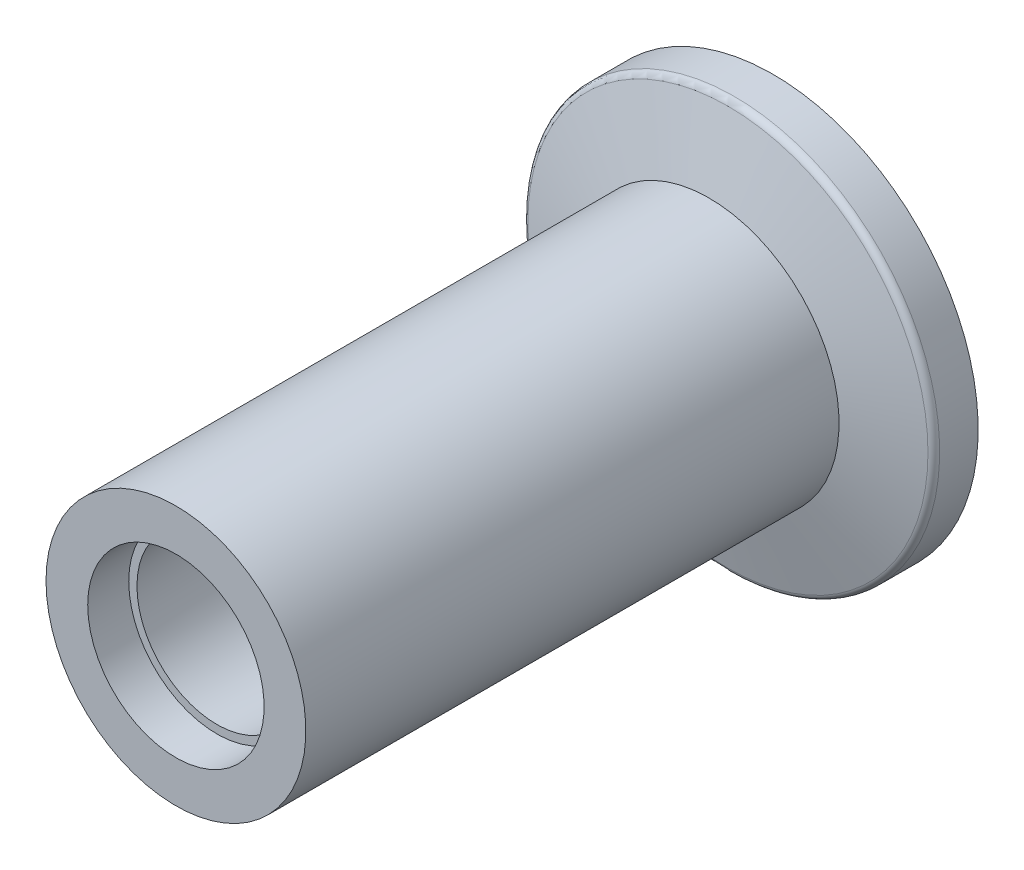
ISO-10303-21;
HEADER;
FILE_DESCRIPTION(('STEP AP214'),'2;1');
FILE_NAME('part.step','',(''),(''),'','','');
FILE_SCHEMA(('AUTOMOTIVE_DESIGN { 1 0 10303 214 1 1 1 1 }'));
ENDSEC;
DATA;
#1=APPLICATION_CONTEXT('core data for automotive mechanical design processes');
#2=APPLICATION_PROTOCOL_DEFINITION('international standard','automotive_design',2000,#1);
#3=PRODUCT_CONTEXT('',#1,'mechanical');
#4=PRODUCT('Part','Part','',(#3));
#5=PRODUCT_RELATED_PRODUCT_CATEGORY('part','',(#4));
#6=PRODUCT_DEFINITION_FORMATION('','',#4);
#7=PRODUCT_DEFINITION_CONTEXT('part definition',#1,'design');
#8=PRODUCT_DEFINITION('design','',#6,#7);
#9=PRODUCT_DEFINITION_SHAPE('','',#8);
#10=(LENGTH_UNIT() NAMED_UNIT(*) SI_UNIT(.MILLI.,.METRE.));
#11=(NAMED_UNIT(*) PLANE_ANGLE_UNIT() SI_UNIT($,.RADIAN.));
#12=(NAMED_UNIT(*) SI_UNIT($,.STERADIAN.) SOLID_ANGLE_UNIT());
#13=UNCERTAINTY_MEASURE_WITH_UNIT(LENGTH_MEASURE(1.E-05),#10,'distance_accuracy_value','');
#14=(GEOMETRIC_REPRESENTATION_CONTEXT(3) GLOBAL_UNCERTAINTY_ASSIGNED_CONTEXT((#13)) GLOBAL_UNIT_ASSIGNED_CONTEXT((#10,
#11,#12)) REPRESENTATION_CONTEXT('',''));
#15=CARTESIAN_POINT('',(0.,0.,0.));
#16=DIRECTION('',(0.,0.,1.));
#17=DIRECTION('',(1.,0.,0.));
#18=AXIS2_PLACEMENT_3D('',#15,#16,#17);
#19=CARTESIAN_POINT('',(0.200000000000021,0.,0.644615947639386));
#20=DIRECTION('',(0.,0.,-1.));
#21=DIRECTION('',(-1.,0.,0.));
#22=AXIS2_PLACEMENT_3D('',#19,#20,#21);
#23=TOROIDAL_SURFACE('',#22,14.5,0.5);
#24=CARTESIAN_POINT('',(0.200000000000022,0.,1.12757886078392));
#25=DIRECTION('',(0.,0.,-1.));
#26=DIRECTION('',(-1.,0.,0.));
#27=AXIS2_PLACEMENT_3D('',#24,#25,#26);
#28=CIRCLE('',#27,14.6294095225513);
#29=CARTESIAN_POINT('',(-14.4294095225512,0.,1.12757886078392));
#30=VERTEX_POINT('',#29);
#31=EDGE_CURVE('E12',#30,#30,#28,.T.);
#32=ORIENTED_EDGE('',*,*,#31,.T.);
#33=EDGE_LOOP('',(#32));
#34=FACE_BOUND('',#33,.T.);
#35=CARTESIAN_POINT('',(0.200000000000022,0.,0.644615947639387));
#36=DIRECTION('',(0.,0.,-1.));
#37=DIRECTION('',(-1.,0.,0.));
#38=AXIS2_PLACEMENT_3D('',#35,#36,#37);
#39=CIRCLE('',#38,15.);
#40=CARTESIAN_POINT('',(-14.8,0.,0.644615947639382));
#41=VERTEX_POINT('',#40);
#42=EDGE_CURVE('E79',#41,#41,#39,.T.);
#43=ORIENTED_EDGE('',*,*,#42,.F.);
#44=EDGE_LOOP('',(#43));
#45=FACE_BOUND('',#44,.T.);
#46=ADVANCED_FACE('F42',(#34,#45),#23,.T.);
#47=CARTESIAN_POINT('',(0.200000000000022,0.,1.12757886078392));
#48=DIRECTION('',(0.,0.,-1.));
#49=DIRECTION('',(-1.,0.,0.));
#50=AXIS2_PLACEMENT_3D('',#47,#48,#49);
#51=CONICAL_SURFACE('',#50,14.6294095225513,1.30899693899575);
#52=CARTESIAN_POINT('',(0.200000000000021,0.,2.50200000000003));
#53=DIRECTION('',(0.,0.,-1.));
#54=DIRECTION('',(-1.,0.,0.));
#55=AXIS2_PLACEMENT_3D('',#52,#53,#54);
#56=CIRCLE('',#55,9.5);
#57=CARTESIAN_POINT('',(-9.29999999999998,0.,2.50200000000002));
#58=VERTEX_POINT('',#57);
#59=EDGE_CURVE('E48',#58,#58,#56,.T.);
#60=ORIENTED_EDGE('',*,*,#59,.T.);
#61=EDGE_LOOP('',(#60));
#62=FACE_BOUND('',#61,.T.);
#63=ORIENTED_EDGE('',*,*,#31,.F.);
#64=EDGE_LOOP('',(#63));
#65=FACE_BOUND('',#64,.T.);
#66=ADVANCED_FACE('F87',(#62,#65),#51,.T.);
#67=CARTESIAN_POINT('',(0.200000000000019,0.,11.872));
#68=DIRECTION('',(0.,0.,-1.));
#69=DIRECTION('',(-1.,0.,0.));
#70=AXIS2_PLACEMENT_3D('',#67,#68,#69);
#71=CYLINDRICAL_SURFACE('',#70,9.5);
#72=CARTESIAN_POINT('',(0.20000000000001,0.,41.490552817085));
#73=DIRECTION('',(0.,0.,-1.));
#74=DIRECTION('',(-1.,0.,0.));
#75=AXIS2_PLACEMENT_3D('',#72,#73,#74);
#76=CIRCLE('',#75,9.50000000000001);
#77=CARTESIAN_POINT('',(-9.3,0.,41.490552817085));
#78=VERTEX_POINT('',#77);
#79=EDGE_CURVE('E52',#78,#78,#76,.T.);
#80=ORIENTED_EDGE('',*,*,#79,.T.);
#81=EDGE_LOOP('',(#80));
#82=FACE_BOUND('',#81,.T.);
#83=ORIENTED_EDGE('',*,*,#59,.F.);
#84=EDGE_LOOP('',(#83));
#85=FACE_BOUND('',#84,.T.);
#86=ADVANCED_FACE('F91',(#82,#85),#71,.T.);
#87=CARTESIAN_POINT('',(9.70000000000001,0.,41.490552817085));
#88=DIRECTION('',(0.,0.,1.));
#89=DIRECTION('',(1.,0.,0.));
#90=AXIS2_PLACEMENT_3D('',#87,#88,#89);
#91=PLANE('',#90);
#92=CARTESIAN_POINT('',(0.20000000000001,0.,41.490552817085));
#93=DIRECTION('',(0.,0.,-1.));
#94=DIRECTION('',(-1.,0.,0.));
#95=AXIS2_PLACEMENT_3D('',#92,#93,#94);
#96=CIRCLE('',#95,6.45);
#97=CARTESIAN_POINT('',(-6.24999999999999,0.,41.490552817085));
#98=VERTEX_POINT('',#97);
#99=EDGE_CURVE('E56',#98,#98,#96,.T.);
#100=ORIENTED_EDGE('',*,*,#99,.T.);
#101=EDGE_LOOP('',(#100));
#102=FACE_BOUND('',#101,.T.);
#103=ORIENTED_EDGE('',*,*,#79,.F.);
#104=EDGE_LOOP('',(#103));
#105=FACE_BOUND('',#104,.T.);
#106=ADVANCED_FACE('F95',(#102,#105),#91,.T.);
#107=CARTESIAN_POINT('',(0.200000000000019,0.,11.872));
#108=DIRECTION('',(0.,0.,-1.));
#109=DIRECTION('',(-1.,0.,0.));
#110=AXIS2_PLACEMENT_3D('',#107,#108,#109);
#111=CYLINDRICAL_SURFACE('',#110,6.45);
#112=CARTESIAN_POINT('',(0.20000000000001,0.,38.490552817085));
#113=DIRECTION('',(0.,0.,-1.));
#114=DIRECTION('',(-1.,0.,0.));
#115=AXIS2_PLACEMENT_3D('',#112,#113,#114);
#116=CIRCLE('',#115,6.45);
#117=CARTESIAN_POINT('',(-6.24999999999999,0.,38.490552817085));
#118=VERTEX_POINT('',#117);
#119=EDGE_CURVE('E61',#118,#118,#116,.T.);
#120=ORIENTED_EDGE('',*,*,#119,.T.);
#121=EDGE_LOOP('',(#120));
#122=FACE_BOUND('',#121,.T.);
#123=ORIENTED_EDGE('',*,*,#99,.F.);
#124=EDGE_LOOP('',(#123));
#125=FACE_BOUND('',#124,.T.);
#126=ADVANCED_FACE('F102',(#122,#125),#111,.F.);
#127=CARTESIAN_POINT('',(6.65000000000001,0.,38.490552817085));
#128=DIRECTION('',(0.,0.,1.));
#129=DIRECTION('',(1.,0.,0.));
#130=AXIS2_PLACEMENT_3D('',#127,#128,#129);
#131=PLANE('',#130);
#132=CARTESIAN_POINT('',(0.20000000000001,0.,38.490552817085));
#133=DIRECTION('',(0.,0.,-1.));
#134=DIRECTION('',(-1.,0.,0.));
#135=AXIS2_PLACEMENT_3D('',#132,#133,#134);
#136=CIRCLE('',#135,5.85);
#137=CARTESIAN_POINT('',(-5.64999999999999,0.,38.490552817085));
#138=VERTEX_POINT('',#137);
#139=EDGE_CURVE('E64',#138,#138,#136,.T.);
#140=ORIENTED_EDGE('',*,*,#139,.T.);
#141=EDGE_LOOP('',(#140));
#142=FACE_BOUND('',#141,.T.);
#143=ORIENTED_EDGE('',*,*,#119,.F.);
#144=EDGE_LOOP('',(#143));
#145=FACE_BOUND('',#144,.T.);
#146=ADVANCED_FACE('F106',(#142,#145),#131,.T.);
#147=CARTESIAN_POINT('',(0.20000000000001,0.,38.490552817085));
#148=DIRECTION('',(0.,0.,-1.));
#149=DIRECTION('',(-1.,0.,0.));
#150=AXIS2_PLACEMENT_3D('',#147,#148,#149);
#151=CONICAL_SURFACE('',#150,5.85,0.0523598775598303);
#152=CARTESIAN_POINT('',(0.200000000000022,0.,0.328279441628868));
#153=DIRECTION('',(0.,0.,-1.));
#154=DIRECTION('',(-1.,0.,0.));
#155=AXIS2_PLACEMENT_3D('',#152,#153,#154);
#156=CIRCLE('',#155,7.85);
#157=CARTESIAN_POINT('',(-7.64999999999998,0.,0.328279441628866));
#158=VERTEX_POINT('',#157);
#159=EDGE_CURVE('E67',#158,#158,#156,.T.);
#160=ORIENTED_EDGE('',*,*,#159,.T.);
#161=EDGE_LOOP('',(#160));
#162=FACE_BOUND('',#161,.T.);
#163=ORIENTED_EDGE('',*,*,#139,.F.);
#164=EDGE_LOOP('',(#163));
#165=FACE_BOUND('',#164,.T.);
#166=ADVANCED_FACE('F110',(#162,#165),#151,.F.);
#167=CARTESIAN_POINT('',(9.20000000000002,0.,0.328279441628871));
#168=DIRECTION('',(0.,0.,-1.));
#169=DIRECTION('',(-1.,0.,0.));
#170=AXIS2_PLACEMENT_3D('',#167,#168,#169);
#171=PLANE('',#170);
#172=CARTESIAN_POINT('',(0.200000000000022,0.,0.328279441628868));
#173=DIRECTION('',(0.,0.,-1.));
#174=DIRECTION('',(-1.,0.,0.));
#175=AXIS2_PLACEMENT_3D('',#172,#173,#174);
#176=CIRCLE('',#175,9.);
#177=CARTESIAN_POINT('',(-8.79999999999998,0.,0.328279441628865));
#178=VERTEX_POINT('',#177);
#179=EDGE_CURVE('E70',#178,#178,#176,.T.);
#180=ORIENTED_EDGE('',*,*,#179,.T.);
#181=EDGE_LOOP('',(#180));
#182=FACE_BOUND('',#181,.T.);
#183=ORIENTED_EDGE('',*,*,#159,.F.);
#184=EDGE_LOOP('',(#183));
#185=FACE_BOUND('',#184,.T.);
#186=ADVANCED_FACE('F114',(#182,#185),#171,.T.);
#187=CARTESIAN_POINT('',(0.200000000000019,0.,11.872));
#188=DIRECTION('',(0.,0.,-1.));
#189=DIRECTION('',(-1.,0.,0.));
#190=AXIS2_PLACEMENT_3D('',#187,#188,#189);
#191=CYLINDRICAL_SURFACE('',#190,9.);
#192=CARTESIAN_POINT('',(0.200000000000023,0.,-2.17172055837113));
#193=DIRECTION('',(0.,0.,-1.));
#194=DIRECTION('',(-1.,0.,0.));
#195=AXIS2_PLACEMENT_3D('',#192,#193,#194);
#196=CIRCLE('',#195,9.);
#197=CARTESIAN_POINT('',(-8.79999999999998,0.,-2.17172055837113));
#198=VERTEX_POINT('',#197);
#199=EDGE_CURVE('E73',#198,#198,#196,.T.);
#200=ORIENTED_EDGE('',*,*,#199,.T.);
#201=EDGE_LOOP('',(#200));
#202=FACE_BOUND('',#201,.T.);
#203=ORIENTED_EDGE('',*,*,#179,.F.);
#204=EDGE_LOOP('',(#203));
#205=FACE_BOUND('',#204,.T.);
#206=ADVANCED_FACE('F118',(#202,#205),#191,.F.);
#207=CARTESIAN_POINT('',(9.20000000000002,0.,-2.17172055837113));
#208=DIRECTION('',(0.,0.,-1.));
#209=DIRECTION('',(-1.,0.,0.));
#210=AXIS2_PLACEMENT_3D('',#207,#208,#209);
#211=PLANE('',#210);
#212=CARTESIAN_POINT('',(0.200000000000023,0.,-2.17172055837113));
#213=DIRECTION('',(0.,0.,-1.));
#214=DIRECTION('',(-1.,0.,0.));
#215=AXIS2_PLACEMENT_3D('',#212,#213,#214);
#216=CIRCLE('',#215,15.);
#217=CARTESIAN_POINT('',(-14.8,0.,-2.17172055837114));
#218=VERTEX_POINT('',#217);
#219=EDGE_CURVE('E76',#218,#218,#216,.T.);
#220=ORIENTED_EDGE('',*,*,#219,.T.);
#221=EDGE_LOOP('',(#220));
#222=FACE_BOUND('',#221,.T.);
#223=ORIENTED_EDGE('',*,*,#199,.F.);
#224=EDGE_LOOP('',(#223));
#225=FACE_BOUND('',#224,.T.);
#226=ADVANCED_FACE('F122',(#222,#225),#211,.T.);
#227=CARTESIAN_POINT('',(0.200000000000019,0.,11.872));
#228=DIRECTION('',(0.,0.,-1.));
#229=DIRECTION('',(-1.,0.,0.));
#230=AXIS2_PLACEMENT_3D('',#227,#228,#229);
#231=CYLINDRICAL_SURFACE('',#230,15.);
#232=ORIENTED_EDGE('',*,*,#42,.T.);
#233=EDGE_LOOP('',(#232));
#234=FACE_BOUND('',#233,.T.);
#235=ORIENTED_EDGE('',*,*,#219,.F.);
#236=EDGE_LOOP('',(#235));
#237=FACE_BOUND('',#236,.T.);
#238=ADVANCED_FACE('F83',(#234,#237),#231,.T.);
#239=CLOSED_SHELL('',(#46,#66,#86,#106,#126,#146,#166,#186,#206,#226,#238));
#240=MANIFOLD_SOLID_BREP('B2',#239);
#241=ADVANCED_BREP_SHAPE_REPRESENTATION('',(#18,#240),#14);
#242=SHAPE_DEFINITION_REPRESENTATION(#9,#241);
ENDSEC;
END-ISO-10303-21;
